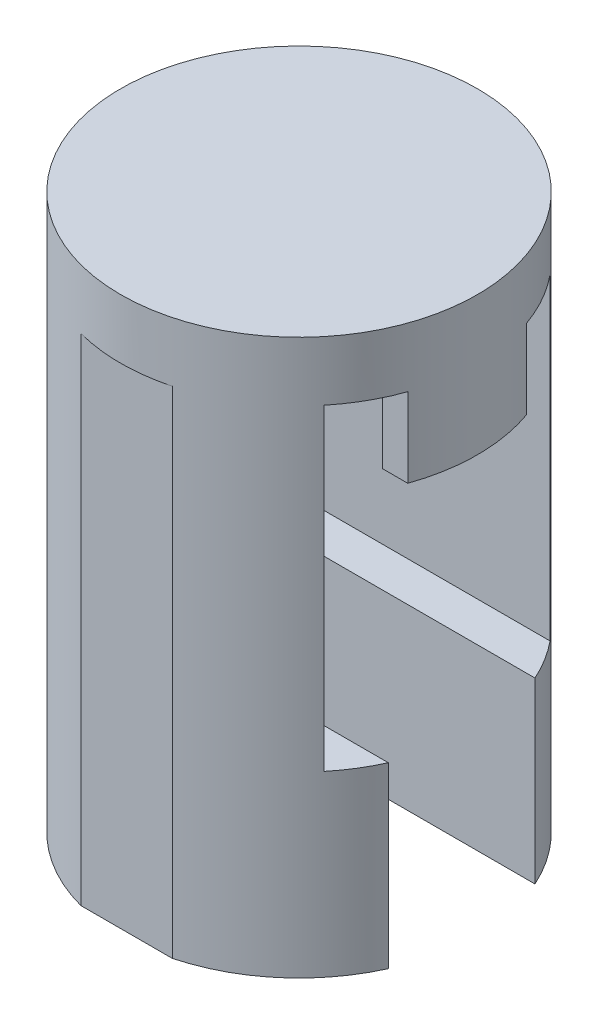
ISO-10303-21;
HEADER;
FILE_DESCRIPTION(('STEP AP214'),'2;1');
FILE_NAME('part.step','',(''),(''),'','','');
FILE_SCHEMA(('AUTOMOTIVE_DESIGN { 1 0 10303 214 1 1 1 1 }'));
ENDSEC;
DATA;
#1=APPLICATION_CONTEXT('core data for automotive mechanical design processes');
#2=APPLICATION_PROTOCOL_DEFINITION('international standard','automotive_design',2000,#1);
#3=PRODUCT_CONTEXT('',#1,'mechanical');
#4=PRODUCT('Part','Part','',(#3));
#5=PRODUCT_RELATED_PRODUCT_CATEGORY('part','',(#4));
#6=PRODUCT_DEFINITION_FORMATION('','',#4);
#7=PRODUCT_DEFINITION_CONTEXT('part definition',#1,'design');
#8=PRODUCT_DEFINITION('design','',#6,#7);
#9=PRODUCT_DEFINITION_SHAPE('','',#8);
#10=(LENGTH_UNIT() NAMED_UNIT(*) SI_UNIT(.MILLI.,.METRE.));
#11=(NAMED_UNIT(*) PLANE_ANGLE_UNIT() SI_UNIT($,.RADIAN.));
#12=(NAMED_UNIT(*) SI_UNIT($,.STERADIAN.) SOLID_ANGLE_UNIT());
#13=UNCERTAINTY_MEASURE_WITH_UNIT(LENGTH_MEASURE(1.E-05),#10,'distance_accuracy_value','');
#14=(GEOMETRIC_REPRESENTATION_CONTEXT(3) GLOBAL_UNCERTAINTY_ASSIGNED_CONTEXT((#13)) GLOBAL_UNIT_ASSIGNED_CONTEXT((#10,
#11,#12)) REPRESENTATION_CONTEXT('',''));
#15=CARTESIAN_POINT('',(0.,0.,0.));
#16=DIRECTION('',(0.,0.,1.));
#17=DIRECTION('',(1.,0.,0.));
#18=AXIS2_PLACEMENT_3D('',#15,#16,#17);
#19=CARTESIAN_POINT('',(0.,0.,0.));
#20=DIRECTION('',(0.,1.,0.));
#21=DIRECTION('',(0.,0.,1.));
#22=AXIS2_PLACEMENT_3D('',#19,#20,#21);
#23=PLANE('',#22);
#24=DIRECTION('',(-1.,0.,0.));
#25=VECTOR('',#24,1.);
#26=CARTESIAN_POINT('',(0.,0.,1.49999999999992));
#27=LINE('',#26,#25);
#28=CARTESIAN_POINT('',(-3.6,0.,1.49999999999999));
#29=VERTEX_POINT('',#28);
#30=CARTESIAN_POINT('',(-4.24264068711928,0.,1.5));
#31=VERTEX_POINT('',#30);
#32=EDGE_CURVE('E250',#29,#31,#27,.T.);
#33=ORIENTED_EDGE('',*,*,#32,.F.);
#34=CARTESIAN_POINT('',(0.,0.,0.));
#35=DIRECTION('',(0.,-1.,0.));
#36=DIRECTION('',(0.,0.,-1.));
#37=AXIS2_PLACEMENT_3D('',#34,#35,#36);
#38=CIRCLE('',#37,3.9);
#39=CARTESIAN_POINT('',(-3.6,0.,-1.50000000000001));
#40=VERTEX_POINT('',#39);
#41=EDGE_CURVE('E235',#29,#40,#38,.T.);
#42=ORIENTED_EDGE('',*,*,#41,.T.);
#43=DIRECTION('',(-1.,0.,0.));
#44=VECTOR('',#43,1.);
#45=CARTESIAN_POINT('',(0.,0.,-1.50000000000008));
#46=LINE('',#45,#44);
#47=CARTESIAN_POINT('',(-4.24264068711928,0.,-1.5));
#48=VERTEX_POINT('',#47);
#49=EDGE_CURVE('E240',#40,#48,#46,.T.);
#50=ORIENTED_EDGE('',*,*,#49,.T.);
#51=CARTESIAN_POINT('',(0.,0.,0.));
#52=DIRECTION('',(0.,1.,0.));
#53=DIRECTION('',(0.,0.,1.));
#54=AXIS2_PLACEMENT_3D('',#51,#52,#53);
#55=CIRCLE('',#54,4.5);
#56=CARTESIAN_POINT('',(-3.48245602987317,0.,-2.85));
#57=VERTEX_POINT('',#56);
#58=EDGE_CURVE('E316',#57,#48,#55,.T.);
#59=ORIENTED_EDGE('',*,*,#58,.F.);
#60=DIRECTION('',(-1.,0.,0.));
#61=VECTOR('',#60,1.);
#62=CARTESIAN_POINT('',(0.,0.,-2.85));
#63=LINE('',#62,#61);
#64=CARTESIAN_POINT('',(3.48245602987317,0.,-2.85));
#65=VERTEX_POINT('',#64);
#66=EDGE_CURVE('E287',#65,#57,#63,.T.);
#67=ORIENTED_EDGE('',*,*,#66,.F.);
#68=CARTESIAN_POINT('',(4.24264068711928,0.,-1.5));
#69=VERTEX_POINT('',#68);
#70=EDGE_CURVE('E317',#69,#65,#55,.T.);
#71=ORIENTED_EDGE('',*,*,#70,.F.);
#72=DIRECTION('',(1.,0.,0.));
#73=VECTOR('',#72,1.);
#74=CARTESIAN_POINT('',(0.,0.,-1.50000000000002));
#75=LINE('',#74,#73);
#76=CARTESIAN_POINT('',(3.6,0.,-1.50000000000001));
#77=VERTEX_POINT('',#76);
#78=EDGE_CURVE('E275',#77,#69,#75,.T.);
#79=ORIENTED_EDGE('',*,*,#78,.F.);
#80=CARTESIAN_POINT('',(0.,0.,0.));
#81=DIRECTION('',(0.,-1.,0.));
#82=DIRECTION('',(0.,0.,-1.));
#83=AXIS2_PLACEMENT_3D('',#80,#81,#82);
#84=CIRCLE('',#83,3.9);
#85=CARTESIAN_POINT('',(3.6,0.,1.49999999999999));
#86=VERTEX_POINT('',#85);
#87=EDGE_CURVE('E260',#77,#86,#84,.T.);
#88=ORIENTED_EDGE('',*,*,#87,.T.);
#89=DIRECTION('',(1.,0.,0.));
#90=VECTOR('',#89,1.);
#91=CARTESIAN_POINT('',(0.,0.,1.49999999999998));
#92=LINE('',#91,#90);
#93=CARTESIAN_POINT('',(4.24264068711929,0.,1.5));
#94=VERTEX_POINT('',#93);
#95=EDGE_CURVE('E265',#86,#94,#92,.T.);
#96=ORIENTED_EDGE('',*,*,#95,.T.);
#97=CARTESIAN_POINT('',(3.48245602987317,0.,2.85));
#98=VERTEX_POINT('',#97);
#99=EDGE_CURVE('E44',#98,#94,#55,.T.);
#100=ORIENTED_EDGE('',*,*,#99,.F.);
#101=DIRECTION('',(1.,0.,0.));
#102=VECTOR('',#101,1.);
#103=CARTESIAN_POINT('',(0.,0.,2.85));
#104=LINE('',#103,#102);
#105=CARTESIAN_POINT('',(-3.48245602987317,0.,2.85));
#106=VERTEX_POINT('',#105);
#107=EDGE_CURVE('E302',#106,#98,#104,.T.);
#108=ORIENTED_EDGE('',*,*,#107,.F.);
#109=EDGE_CURVE('E315',#31,#106,#55,.T.);
#110=ORIENTED_EDGE('',*,*,#109,.F.);
#111=EDGE_LOOP('',(#33,#42,#50,#59,#67,#71,#79,#88,#96,#100,#108,#110));
#112=FACE_BOUND('',#111,.T.);
#113=ADVANCED_FACE('F35',(#112),#23,.F.);
#114=DIRECTION('',(1.,0.,0.));
#115=VECTOR('',#114,1.);
#116=CARTESIAN_POINT('',(0.,0.,-4.35));
#117=LINE('',#116,#115);
#118=CARTESIAN_POINT('',(-1.15217186218029,0.,-4.35));
#119=VERTEX_POINT('',#118);
#120=CARTESIAN_POINT('',(1.15217186218029,0.,-4.35));
#121=VERTEX_POINT('',#120);
#122=EDGE_CURVE('E285',#119,#121,#117,.T.);
#123=ORIENTED_EDGE('',*,*,#122,.F.);
#124=EDGE_CURVE('E319',#121,#119,#55,.T.);
#125=ORIENTED_EDGE('',*,*,#124,.F.);
#126=EDGE_LOOP('',(#123,#125));
#127=FACE_BOUND('',#126,.T.);
#128=ADVANCED_FACE('F357',(#127),#23,.F.);
#129=CARTESIAN_POINT('',(0.,1.5,0.));
#130=DIRECTION('',(0.,-1.,0.));
#131=DIRECTION('',(0.,0.,-1.));
#132=AXIS2_PLACEMENT_3D('',#129,#130,#131);
#133=CYLINDRICAL_SURFACE('',#132,4.5);
#134=CARTESIAN_POINT('',(0.,1.5,0.));
#135=DIRECTION('',(0.,1.,0.));
#136=DIRECTION('',(0.,0.,1.));
#137=AXIS2_PLACEMENT_3D('',#134,#135,#136);
#138=CIRCLE('',#137,4.5);
#139=CARTESIAN_POINT('',(0.,1.5,4.5));
#140=VERTEX_POINT('',#139);
#141=EDGE_CURVE('E11',#140,#140,#138,.T.);
#142=ORIENTED_EDGE('',*,*,#141,.F.);
#143=EDGE_LOOP('',(#142));
#144=FACE_BOUND('',#143,.T.);
#145=CARTESIAN_POINT('',(-1.15217186218029,0.,4.35));
#146=VERTEX_POINT('',#145);
#147=CARTESIAN_POINT('',(1.15217186218029,0.,4.35));
#148=VERTEX_POINT('',#147);
#149=EDGE_CURVE('E39',#146,#148,#55,.T.);
#150=ORIENTED_EDGE('',*,*,#149,.T.);
#151=DIRECTION('',(0.,1.,0.));
#152=VECTOR('',#151,1.);
#153=CARTESIAN_POINT('',(1.15217186218029,-2.,4.35));
#154=LINE('',#153,#152);
#155=CARTESIAN_POINT('',(1.15217186218029,-12.5,4.35));
#156=VERTEX_POINT('',#155);
#157=EDGE_CURVE('E181',#156,#148,#154,.T.);
#158=ORIENTED_EDGE('',*,*,#157,.F.);
#159=CARTESIAN_POINT('',(0.,-12.5,0.));
#160=DIRECTION('',(0.,-1.,0.));
#161=DIRECTION('',(0.,0.,-1.));
#162=AXIS2_PLACEMENT_3D('',#159,#160,#161);
#163=CIRCLE('',#162,4.5);
#164=CARTESIAN_POINT('',(4.10213359119373,-12.5,1.85));
#165=VERTEX_POINT('',#164);
#166=EDGE_CURVE('E173',#165,#156,#163,.T.);
#167=ORIENTED_EDGE('',*,*,#166,.F.);
#168=DIRECTION('',(0.,1.,0.));
#169=VECTOR('',#168,1.);
#170=CARTESIAN_POINT('',(4.10213359119373,-12.5,1.85));
#171=LINE('',#170,#169);
#172=CARTESIAN_POINT('',(4.10213359119373,-8.,1.85));
#173=VERTEX_POINT('',#172);
#174=EDGE_CURVE('E178',#165,#173,#171,.T.);
#175=ORIENTED_EDGE('',*,*,#174,.T.);
#176=CARTESIAN_POINT('',(0.,-8.,0.));
#177=DIRECTION('',(0.,-1.,0.));
#178=DIRECTION('',(0.,0.,-1.));
#179=AXIS2_PLACEMENT_3D('',#176,#177,#178);
#180=CIRCLE('',#179,4.5);
#181=CARTESIAN_POINT('',(3.48245602987317,-8.,2.85));
#182=VERTEX_POINT('',#181);
#183=EDGE_CURVE('E348',#173,#182,#180,.T.);
#184=ORIENTED_EDGE('',*,*,#183,.T.);
#185=DIRECTION('',(0.,1.,0.));
#186=VECTOR('',#185,1.);
#187=CARTESIAN_POINT('',(3.48245602987317,-2.,2.85));
#188=LINE('',#187,#186);
#189=EDGE_CURVE('E306',#182,#98,#188,.T.);
#190=ORIENTED_EDGE('',*,*,#189,.T.);
#191=ORIENTED_EDGE('',*,*,#99,.T.);
#192=DIRECTION('',(0.,1.,0.));
#193=VECTOR('',#192,1.);
#194=CARTESIAN_POINT('',(4.24264068711929,-2.,1.5));
#195=LINE('',#194,#193);
#196=CARTESIAN_POINT('',(4.24264068711929,-2.,1.5));
#197=VERTEX_POINT('',#196);
#198=EDGE_CURVE('E280',#197,#94,#195,.T.);
#199=ORIENTED_EDGE('',*,*,#198,.F.);
#200=CARTESIAN_POINT('',(0.,-2.,0.));
#201=DIRECTION('',(0.,-1.,0.));
#202=DIRECTION('',(0.,0.,-1.));
#203=AXIS2_PLACEMENT_3D('',#200,#201,#202);
#204=CIRCLE('',#203,4.5);
#205=CARTESIAN_POINT('',(4.24264068711928,-2.,-1.5));
#206=VERTEX_POINT('',#205);
#207=EDGE_CURVE('E267',#206,#197,#204,.T.);
#208=ORIENTED_EDGE('',*,*,#207,.F.);
#209=DIRECTION('',(0.,1.,0.));
#210=VECTOR('',#209,1.);
#211=CARTESIAN_POINT('',(4.24264068711928,-2.,-1.5));
#212=LINE('',#211,#210);
#213=EDGE_CURVE('E58',#206,#69,#212,.T.);
#214=ORIENTED_EDGE('',*,*,#213,.T.);
#215=ORIENTED_EDGE('',*,*,#70,.T.);
#216=DIRECTION('',(0.,1.,0.));
#217=VECTOR('',#216,1.);
#218=CARTESIAN_POINT('',(3.48245602987317,-2.,-2.85));
#219=LINE('',#218,#217);
#220=CARTESIAN_POINT('',(3.48245602987317,-8.,-2.85));
#221=VERTEX_POINT('',#220);
#222=EDGE_CURVE('E292',#221,#65,#219,.T.);
#223=ORIENTED_EDGE('',*,*,#222,.F.);
#224=CARTESIAN_POINT('',(0.,-8.,0.));
#225=DIRECTION('',(0.,-1.,0.));
#226=DIRECTION('',(0.,0.,-1.));
#227=AXIS2_PLACEMENT_3D('',#224,#225,#226);
#228=CIRCLE('',#227,4.5);
#229=CARTESIAN_POINT('',(4.10213359119373,-8.,-1.85));
#230=VERTEX_POINT('',#229);
#231=EDGE_CURVE('E200',#221,#230,#228,.T.);
#232=ORIENTED_EDGE('',*,*,#231,.T.);
#233=DIRECTION('',(0.,1.,0.));
#234=VECTOR('',#233,1.);
#235=CARTESIAN_POINT('',(4.10213359119373,-12.5,-1.85));
#236=LINE('',#235,#234);
#237=CARTESIAN_POINT('',(4.10213359119373,-12.5,-1.85));
#238=VERTEX_POINT('',#237);
#239=EDGE_CURVE('E226',#238,#230,#236,.T.);
#240=ORIENTED_EDGE('',*,*,#239,.F.);
#241=CARTESIAN_POINT('',(0.,-12.5,0.));
#242=DIRECTION('',(0.,-1.,0.));
#243=DIRECTION('',(0.,0.,-1.));
#244=AXIS2_PLACEMENT_3D('',#241,#242,#243);
#245=CIRCLE('',#244,4.5);
#246=CARTESIAN_POINT('',(1.15217186218029,-12.5,-4.35));
#247=VERTEX_POINT('',#246);
#248=EDGE_CURVE('E208',#247,#238,#245,.T.);
#249=ORIENTED_EDGE('',*,*,#248,.F.);
#250=DIRECTION('',(0.,1.,0.));
#251=VECTOR('',#250,1.);
#252=CARTESIAN_POINT('',(1.15217186218029,-2.,-4.35));
#253=LINE('',#252,#251);
#254=EDGE_CURVE('E295',#247,#121,#253,.T.);
#255=ORIENTED_EDGE('',*,*,#254,.T.);
#256=ORIENTED_EDGE('',*,*,#124,.T.);
#257=DIRECTION('',(0.,1.,0.));
#258=VECTOR('',#257,1.);
#259=CARTESIAN_POINT('',(-1.15217186218029,-2.,-4.35));
#260=LINE('',#259,#258);
#261=CARTESIAN_POINT('',(-1.15217186218029,-12.5,-4.35));
#262=VERTEX_POINT('',#261);
#263=EDGE_CURVE('E298',#262,#119,#260,.T.);
#264=ORIENTED_EDGE('',*,*,#263,.F.);
#265=CARTESIAN_POINT('',(0.,-12.5,0.));
#266=DIRECTION('',(0.,-1.,0.));
#267=DIRECTION('',(0.,0.,-1.));
#268=AXIS2_PLACEMENT_3D('',#265,#266,#267);
#269=CIRCLE('',#268,4.5);
#270=CARTESIAN_POINT('',(-4.10213359119373,-12.5,-1.85));
#271=VERTEX_POINT('',#270);
#272=EDGE_CURVE('E214',#271,#262,#269,.T.);
#273=ORIENTED_EDGE('',*,*,#272,.F.);
#274=DIRECTION('',(0.,1.,0.));
#275=VECTOR('',#274,1.);
#276=CARTESIAN_POINT('',(-4.10213359119373,-12.5,-1.85));
#277=LINE('',#276,#275);
#278=CARTESIAN_POINT('',(-4.10213359119373,-8.,-1.85));
#279=VERTEX_POINT('',#278);
#280=EDGE_CURVE('E219',#271,#279,#277,.T.);
#281=ORIENTED_EDGE('',*,*,#280,.T.);
#282=CARTESIAN_POINT('',(0.,-8.,0.));
#283=DIRECTION('',(0.,-1.,0.));
#284=DIRECTION('',(0.,0.,-1.));
#285=AXIS2_PLACEMENT_3D('',#282,#283,#284);
#286=CIRCLE('',#285,4.5);
#287=CARTESIAN_POINT('',(-3.48245602987317,-8.,-2.85));
#288=VERTEX_POINT('',#287);
#289=EDGE_CURVE('E212',#279,#288,#286,.T.);
#290=ORIENTED_EDGE('',*,*,#289,.T.);
#291=DIRECTION('',(0.,1.,0.));
#292=VECTOR('',#291,1.);
#293=CARTESIAN_POINT('',(-3.48245602987317,-2.,-2.85));
#294=LINE('',#293,#292);
#295=EDGE_CURVE('E290',#288,#57,#294,.T.);
#296=ORIENTED_EDGE('',*,*,#295,.T.);
#297=ORIENTED_EDGE('',*,*,#58,.T.);
#298=DIRECTION('',(0.,1.,0.));
#299=VECTOR('',#298,1.);
#300=CARTESIAN_POINT('',(-4.24264068711928,-2.,-1.5));
#301=LINE('',#300,#299);
#302=CARTESIAN_POINT('',(-4.24264068711928,-2.,-1.5));
#303=VERTEX_POINT('',#302);
#304=EDGE_CURVE('E255',#303,#48,#301,.T.);
#305=ORIENTED_EDGE('',*,*,#304,.F.);
#306=CARTESIAN_POINT('',(0.,-2.,0.));
#307=DIRECTION('',(0.,-1.,0.));
#308=DIRECTION('',(0.,0.,-1.));
#309=AXIS2_PLACEMENT_3D('',#306,#307,#308);
#310=CIRCLE('',#309,4.5);
#311=CARTESIAN_POINT('',(-4.24264068711928,-2.,1.5));
#312=VERTEX_POINT('',#311);
#313=EDGE_CURVE('E242',#312,#303,#310,.T.);
#314=ORIENTED_EDGE('',*,*,#313,.F.);
#315=DIRECTION('',(0.,1.,0.));
#316=VECTOR('',#315,1.);
#317=CARTESIAN_POINT('',(-4.24264068711928,-2.,1.5));
#318=LINE('',#317,#316);
#319=EDGE_CURVE('E51',#312,#31,#318,.T.);
#320=ORIENTED_EDGE('',*,*,#319,.T.);
#321=ORIENTED_EDGE('',*,*,#109,.T.);
#322=DIRECTION('',(0.,1.,0.));
#323=VECTOR('',#322,1.);
#324=CARTESIAN_POINT('',(-3.48245602987317,-2.,2.85));
#325=LINE('',#324,#323);
#326=CARTESIAN_POINT('',(-3.48245602987317,-8.,2.85));
#327=VERTEX_POINT('',#326);
#328=EDGE_CURVE('E309',#327,#106,#325,.T.);
#329=ORIENTED_EDGE('',*,*,#328,.F.);
#330=CARTESIAN_POINT('',(-4.10213359119373,-8.,1.85));
#331=VERTEX_POINT('',#330);
#332=EDGE_CURVE('E195',#327,#331,#180,.T.);
#333=ORIENTED_EDGE('',*,*,#332,.T.);
#334=DIRECTION('',(0.,1.,0.));
#335=VECTOR('',#334,1.);
#336=CARTESIAN_POINT('',(-4.10213359119373,-12.5,1.85));
#337=LINE('',#336,#335);
#338=CARTESIAN_POINT('',(-4.10213359119373,-12.5,1.85));
#339=VERTEX_POINT('',#338);
#340=EDGE_CURVE('E201',#339,#331,#337,.T.);
#341=ORIENTED_EDGE('',*,*,#340,.F.);
#342=CARTESIAN_POINT('',(-1.15217186218029,-12.5,4.35));
#343=VERTEX_POINT('',#342);
#344=EDGE_CURVE('E188',#343,#339,#163,.T.);
#345=ORIENTED_EDGE('',*,*,#344,.F.);
#346=DIRECTION('',(0.,1.,0.));
#347=VECTOR('',#346,1.);
#348=CARTESIAN_POINT('',(-1.15217186218029,-2.,4.35));
#349=LINE('',#348,#347);
#350=EDGE_CURVE('E312',#343,#146,#349,.T.);
#351=ORIENTED_EDGE('',*,*,#350,.T.);
#352=EDGE_LOOP('',(#150,#158,#167,#175,#184,#190,#191,#199,#208,#214,#215,#223,#232,#240,#249,
#255,#256,#264,#273,#281,#290,#296,#297,#305,#314,#320,#321,#329,#333,#341,#345,#351));
#353=FACE_BOUND('',#352,.T.);
#354=ADVANCED_FACE('F37',(#144,#353),#133,.T.);
#355=CARTESIAN_POINT('',(0.,1.5,0.));
#356=DIRECTION('',(0.,1.,0.));
#357=DIRECTION('',(0.,0.,1.));
#358=AXIS2_PLACEMENT_3D('',#355,#356,#357);
#359=PLANE('',#358);
#360=ORIENTED_EDGE('',*,*,#141,.T.);
#361=EDGE_LOOP('',(#360));
#362=FACE_BOUND('',#361,.T.);
#363=ADVANCED_FACE('F356',(#362),#359,.T.);
#364=ORIENTED_EDGE('',*,*,#149,.F.);
#365=DIRECTION('',(1.,0.,0.));
#366=VECTOR('',#365,1.);
#367=CARTESIAN_POINT('',(0.,0.,4.35));
#368=LINE('',#367,#366);
#369=EDGE_CURVE('E300',#146,#148,#368,.T.);
#370=ORIENTED_EDGE('',*,*,#369,.T.);
#371=EDGE_LOOP('',(#364,#370));
#372=FACE_BOUND('',#371,.T.);
#373=ADVANCED_FACE('F354',(#372),#23,.F.);
#374=CARTESIAN_POINT('',(0.,-2.,4.35));
#375=DIRECTION('',(0.,0.,1.));
#376=DIRECTION('',(1.,0.,0.));
#377=AXIS2_PLACEMENT_3D('',#374,#375,#376);
#378=PLANE('',#377);
#379=ORIENTED_EDGE('',*,*,#369,.F.);
#380=ORIENTED_EDGE('',*,*,#350,.F.);
#381=DIRECTION('',(-1.,0.,0.));
#382=VECTOR('',#381,1.);
#383=CARTESIAN_POINT('',(0.,-12.5,4.35));
#384=LINE('',#383,#382);
#385=EDGE_CURVE('E185',#156,#343,#384,.T.);
#386=ORIENTED_EDGE('',*,*,#385,.F.);
#387=ORIENTED_EDGE('',*,*,#157,.T.);
#388=EDGE_LOOP('',(#379,#380,#386,#387));
#389=FACE_BOUND('',#388,.T.);
#390=ADVANCED_FACE('F352',(#389),#378,.T.);
#391=CARTESIAN_POINT('',(0.,-2.,2.85));
#392=DIRECTION('',(0.,0.,1.));
#393=DIRECTION('',(1.,0.,0.));
#394=AXIS2_PLACEMENT_3D('',#391,#392,#393);
#395=PLANE('',#394);
#396=ORIENTED_EDGE('',*,*,#107,.T.);
#397=ORIENTED_EDGE('',*,*,#189,.F.);
#398=DIRECTION('',(1.,0.,0.));
#399=VECTOR('',#398,1.);
#400=CARTESIAN_POINT('',(0.,-8.,2.85));
#401=LINE('',#400,#399);
#402=EDGE_CURVE('E232',#327,#182,#401,.T.);
#403=ORIENTED_EDGE('',*,*,#402,.F.);
#404=ORIENTED_EDGE('',*,*,#328,.T.);
#405=EDGE_LOOP('',(#396,#397,#403,#404));
#406=FACE_BOUND('',#405,.T.);
#407=ADVANCED_FACE('F362',(#406),#395,.F.);
#408=CARTESIAN_POINT('',(0.,-2.,-4.35));
#409=DIRECTION('',(0.,0.,1.));
#410=DIRECTION('',(1.,0.,0.));
#411=AXIS2_PLACEMENT_3D('',#408,#409,#410);
#412=PLANE('',#411);
#413=ORIENTED_EDGE('',*,*,#122,.T.);
#414=ORIENTED_EDGE('',*,*,#254,.F.);
#415=DIRECTION('',(1.,0.,0.));
#416=VECTOR('',#415,1.);
#417=CARTESIAN_POINT('',(0.,-12.5,-4.35));
#418=LINE('',#417,#416);
#419=EDGE_CURVE('E217',#262,#247,#418,.T.);
#420=ORIENTED_EDGE('',*,*,#419,.F.);
#421=ORIENTED_EDGE('',*,*,#263,.T.);
#422=EDGE_LOOP('',(#413,#414,#420,#421));
#423=FACE_BOUND('',#422,.T.);
#424=ADVANCED_FACE('F375',(#423),#412,.F.);
#425=CARTESIAN_POINT('',(0.,-2.,-2.85));
#426=DIRECTION('',(0.,0.,-1.));
#427=DIRECTION('',(-1.,0.,0.));
#428=AXIS2_PLACEMENT_3D('',#425,#426,#427);
#429=PLANE('',#428);
#430=ORIENTED_EDGE('',*,*,#66,.T.);
#431=ORIENTED_EDGE('',*,*,#295,.F.);
#432=DIRECTION('',(-1.,0.,0.));
#433=VECTOR('',#432,1.);
#434=CARTESIAN_POINT('',(0.,-8.,-2.85));
#435=LINE('',#434,#433);
#436=EDGE_CURVE('E229',#221,#288,#435,.T.);
#437=ORIENTED_EDGE('',*,*,#436,.F.);
#438=ORIENTED_EDGE('',*,*,#222,.T.);
#439=EDGE_LOOP('',(#430,#431,#437,#438));
#440=FACE_BOUND('',#439,.T.);
#441=ADVANCED_FACE('F391',(#440),#429,.F.);
#442=CARTESIAN_POINT('',(0.,-2.,0.));
#443=DIRECTION('',(0.,1.,0.));
#444=DIRECTION('',(0.,0.,1.));
#445=AXIS2_PLACEMENT_3D('',#442,#443,#444);
#446=CYLINDRICAL_SURFACE('',#445,3.9);
#447=ORIENTED_EDGE('',*,*,#87,.F.);
#448=DIRECTION('',(0.,1.,0.));
#449=VECTOR('',#448,1.);
#450=CARTESIAN_POINT('',(3.6,-2.,-1.50000000000001));
#451=LINE('',#450,#449);
#452=CARTESIAN_POINT('',(3.6,-2.,-1.50000000000001));
#453=VERTEX_POINT('',#452);
#454=EDGE_CURVE('E283',#453,#77,#451,.T.);
#455=ORIENTED_EDGE('',*,*,#454,.F.);
#456=CARTESIAN_POINT('',(0.,-2.,0.));
#457=DIRECTION('',(0.,-1.,0.));
#458=DIRECTION('',(0.,0.,-1.));
#459=AXIS2_PLACEMENT_3D('',#456,#457,#458);
#460=CIRCLE('',#459,3.9);
#461=CARTESIAN_POINT('',(3.6,-2.,1.49999999999999));
#462=VERTEX_POINT('',#461);
#463=EDGE_CURVE('E261',#453,#462,#460,.T.);
#464=ORIENTED_EDGE('',*,*,#463,.T.);
#465=DIRECTION('',(0.,1.,0.));
#466=VECTOR('',#465,1.);
#467=CARTESIAN_POINT('',(3.6,-2.,1.49999999999999));
#468=LINE('',#467,#466);
#469=EDGE_CURVE('E272',#462,#86,#468,.T.);
#470=ORIENTED_EDGE('',*,*,#469,.T.);
#471=EDGE_LOOP('',(#447,#455,#464,#470));
#472=FACE_BOUND('',#471,.T.);
#473=ADVANCED_FACE('F399',(#472),#446,.F.);
#474=CARTESIAN_POINT('',(0.,-2.,-1.50000000000002));
#475=DIRECTION('',(0.,0.,1.));
#476=DIRECTION('',(1.,0.,0.));
#477=AXIS2_PLACEMENT_3D('',#474,#475,#476);
#478=PLANE('',#477);
#479=ORIENTED_EDGE('',*,*,#78,.T.);
#480=ORIENTED_EDGE('',*,*,#213,.F.);
#481=DIRECTION('',(1.,0.,0.));
#482=VECTOR('',#481,1.);
#483=CARTESIAN_POINT('',(0.,-2.,-1.50000000000002));
#484=LINE('',#483,#482);
#485=EDGE_CURVE('E264',#453,#206,#484,.T.);
#486=ORIENTED_EDGE('',*,*,#485,.F.);
#487=ORIENTED_EDGE('',*,*,#454,.T.);
#488=EDGE_LOOP('',(#479,#480,#486,#487));
#489=FACE_BOUND('',#488,.T.);
#490=ADVANCED_FACE('F395',(#489),#478,.F.);
#491=CARTESIAN_POINT('',(0.,-2.,1.49999999999998));
#492=DIRECTION('',(0.,0.,1.));
#493=DIRECTION('',(1.,0.,0.));
#494=AXIS2_PLACEMENT_3D('',#491,#492,#493);
#495=PLANE('',#494);
#496=ORIENTED_EDGE('',*,*,#95,.F.);
#497=ORIENTED_EDGE('',*,*,#469,.F.);
#498=DIRECTION('',(1.,0.,0.));
#499=VECTOR('',#498,1.);
#500=CARTESIAN_POINT('',(0.,-2.,1.49999999999998));
#501=LINE('',#500,#499);
#502=EDGE_CURVE('E269',#462,#197,#501,.T.);
#503=ORIENTED_EDGE('',*,*,#502,.T.);
#504=ORIENTED_EDGE('',*,*,#198,.T.);
#505=EDGE_LOOP('',(#496,#497,#503,#504));
#506=FACE_BOUND('',#505,.T.);
#507=ADVANCED_FACE('F403',(#506),#495,.T.);
#508=CARTESIAN_POINT('',(0.,-2.,0.));
#509=DIRECTION('',(0.,-1.,0.));
#510=DIRECTION('',(0.,0.,-1.));
#511=AXIS2_PLACEMENT_3D('',#508,#509,#510);
#512=PLANE('',#511);
#513=ORIENTED_EDGE('',*,*,#463,.F.);
#514=ORIENTED_EDGE('',*,*,#485,.T.);
#515=ORIENTED_EDGE('',*,*,#207,.T.);
#516=ORIENTED_EDGE('',*,*,#502,.F.);
#517=EDGE_LOOP('',(#513,#514,#515,#516));
#518=FACE_BOUND('',#517,.T.);
#519=ADVANCED_FACE('F419',(#518),#512,.T.);
#520=CARTESIAN_POINT('',(0.,-2.,0.));
#521=DIRECTION('',(0.,1.,0.));
#522=DIRECTION('',(0.,0.,1.));
#523=AXIS2_PLACEMENT_3D('',#520,#521,#522);
#524=CYLINDRICAL_SURFACE('',#523,3.9);
#525=ORIENTED_EDGE('',*,*,#41,.F.);
#526=DIRECTION('',(0.,1.,0.));
#527=VECTOR('',#526,1.);
#528=CARTESIAN_POINT('',(-3.6,-2.,1.49999999999999));
#529=LINE('',#528,#527);
#530=CARTESIAN_POINT('',(-3.6,-2.,1.49999999999999));
#531=VERTEX_POINT('',#530);
#532=EDGE_CURVE('E258',#531,#29,#529,.T.);
#533=ORIENTED_EDGE('',*,*,#532,.F.);
#534=CARTESIAN_POINT('',(0.,-2.,0.));
#535=DIRECTION('',(0.,-1.,0.));
#536=DIRECTION('',(0.,0.,-1.));
#537=AXIS2_PLACEMENT_3D('',#534,#535,#536);
#538=CIRCLE('',#537,3.9);
#539=CARTESIAN_POINT('',(-3.6,-2.,-1.50000000000001));
#540=VERTEX_POINT('',#539);
#541=EDGE_CURVE('E236',#531,#540,#538,.T.);
#542=ORIENTED_EDGE('',*,*,#541,.T.);
#543=DIRECTION('',(0.,1.,0.));
#544=VECTOR('',#543,1.);
#545=CARTESIAN_POINT('',(-3.6,-2.,-1.50000000000001));
#546=LINE('',#545,#544);
#547=EDGE_CURVE('E247',#540,#40,#546,.T.);
#548=ORIENTED_EDGE('',*,*,#547,.T.);
#549=EDGE_LOOP('',(#525,#533,#542,#548));
#550=FACE_BOUND('',#549,.T.);
#551=ADVANCED_FACE('F422',(#550),#524,.F.);
#552=CARTESIAN_POINT('',(0.,-2.,1.49999999999992));
#553=DIRECTION('',(0.,0.,-1.));
#554=DIRECTION('',(-1.,0.,0.));
#555=AXIS2_PLACEMENT_3D('',#552,#553,#554);
#556=PLANE('',#555);
#557=ORIENTED_EDGE('',*,*,#32,.T.);
#558=ORIENTED_EDGE('',*,*,#319,.F.);
#559=DIRECTION('',(-1.,0.,0.));
#560=VECTOR('',#559,1.);
#561=CARTESIAN_POINT('',(0.,-2.,1.49999999999992));
#562=LINE('',#561,#560);
#563=EDGE_CURVE('E239',#531,#312,#562,.T.);
#564=ORIENTED_EDGE('',*,*,#563,.F.);
#565=ORIENTED_EDGE('',*,*,#532,.T.);
#566=EDGE_LOOP('',(#557,#558,#564,#565));
#567=FACE_BOUND('',#566,.T.);
#568=ADVANCED_FACE('F340',(#567),#556,.F.);
#569=CARTESIAN_POINT('',(0.,-2.,-1.50000000000008));
#570=DIRECTION('',(0.,0.,-1.));
#571=DIRECTION('',(-1.,0.,0.));
#572=AXIS2_PLACEMENT_3D('',#569,#570,#571);
#573=PLANE('',#572);
#574=ORIENTED_EDGE('',*,*,#49,.F.);
#575=ORIENTED_EDGE('',*,*,#547,.F.);
#576=DIRECTION('',(-1.,0.,0.));
#577=VECTOR('',#576,1.);
#578=CARTESIAN_POINT('',(0.,-2.,-1.50000000000008));
#579=LINE('',#578,#577);
#580=EDGE_CURVE('E244',#540,#303,#579,.T.);
#581=ORIENTED_EDGE('',*,*,#580,.T.);
#582=ORIENTED_EDGE('',*,*,#304,.T.);
#583=EDGE_LOOP('',(#574,#575,#581,#582));
#584=FACE_BOUND('',#583,.T.);
#585=ADVANCED_FACE('F333',(#584),#573,.T.);
#586=CARTESIAN_POINT('',(0.,-2.,0.));
#587=DIRECTION('',(0.,-1.,0.));
#588=DIRECTION('',(0.,0.,-1.));
#589=AXIS2_PLACEMENT_3D('',#586,#587,#588);
#590=PLANE('',#589);
#591=ORIENTED_EDGE('',*,*,#541,.F.);
#592=ORIENTED_EDGE('',*,*,#563,.T.);
#593=ORIENTED_EDGE('',*,*,#313,.T.);
#594=ORIENTED_EDGE('',*,*,#580,.F.);
#595=EDGE_LOOP('',(#591,#592,#593,#594));
#596=FACE_BOUND('',#595,.T.);
#597=ADVANCED_FACE('F337',(#596),#590,.T.);
#598=CARTESIAN_POINT('',(0.,-8.,0.));
#599=DIRECTION('',(0.,-1.,0.));
#600=DIRECTION('',(0.,0.,-1.));
#601=AXIS2_PLACEMENT_3D('',#598,#599,#600);
#602=PLANE('',#601);
#603=ORIENTED_EDGE('',*,*,#231,.F.);
#604=ORIENTED_EDGE('',*,*,#436,.T.);
#605=ORIENTED_EDGE('',*,*,#289,.F.);
#606=DIRECTION('',(-1.,0.,0.));
#607=VECTOR('',#606,1.);
#608=CARTESIAN_POINT('',(0.,-8.,-1.85));
#609=LINE('',#608,#607);
#610=EDGE_CURVE('E203',#230,#279,#609,.T.);
#611=ORIENTED_EDGE('',*,*,#610,.F.);
#612=EDGE_LOOP('',(#603,#604,#605,#611));
#613=FACE_BOUND('',#612,.T.);
#614=ADVANCED_FACE('F388',(#613),#602,.F.);
#615=CARTESIAN_POINT('',(0.,-12.5,-1.85));
#616=DIRECTION('',(0.,0.,-1.));
#617=DIRECTION('',(-1.,0.,0.));
#618=AXIS2_PLACEMENT_3D('',#615,#616,#617);
#619=PLANE('',#618);
#620=ORIENTED_EDGE('',*,*,#610,.T.);
#621=ORIENTED_EDGE('',*,*,#280,.F.);
#622=DIRECTION('',(-1.,0.,0.));
#623=VECTOR('',#622,1.);
#624=CARTESIAN_POINT('',(0.,-12.5,-1.85));
#625=LINE('',#624,#623);
#626=EDGE_CURVE('E211',#238,#271,#625,.T.);
#627=ORIENTED_EDGE('',*,*,#626,.F.);
#628=ORIENTED_EDGE('',*,*,#239,.T.);
#629=EDGE_LOOP('',(#620,#621,#627,#628));
#630=FACE_BOUND('',#629,.T.);
#631=ADVANCED_FACE('F433',(#630),#619,.F.);
#632=CARTESIAN_POINT('',(0.,-12.5,0.));
#633=DIRECTION('',(0.,-1.,0.));
#634=DIRECTION('',(0.,0.,-1.));
#635=AXIS2_PLACEMENT_3D('',#632,#633,#634);
#636=PLANE('',#635);
#637=ORIENTED_EDGE('',*,*,#248,.T.);
#638=ORIENTED_EDGE('',*,*,#626,.T.);
#639=ORIENTED_EDGE('',*,*,#272,.T.);
#640=ORIENTED_EDGE('',*,*,#419,.T.);
#641=EDGE_LOOP('',(#637,#638,#639,#640));
#642=FACE_BOUND('',#641,.T.);
#643=ADVANCED_FACE('F380',(#642),#636,.T.);
#644=CARTESIAN_POINT('',(0.,-8.,0.));
#645=DIRECTION('',(0.,-1.,0.));
#646=DIRECTION('',(0.,0.,-1.));
#647=AXIS2_PLACEMENT_3D('',#644,#645,#646);
#648=PLANE('',#647);
#649=ORIENTED_EDGE('',*,*,#332,.F.);
#650=ORIENTED_EDGE('',*,*,#402,.T.);
#651=ORIENTED_EDGE('',*,*,#183,.F.);
#652=DIRECTION('',(1.,0.,0.));
#653=VECTOR('',#652,1.);
#654=CARTESIAN_POINT('',(0.,-8.,1.85));
#655=LINE('',#654,#653);
#656=EDGE_CURVE('E199',#331,#173,#655,.T.);
#657=ORIENTED_EDGE('',*,*,#656,.F.);
#658=EDGE_LOOP('',(#649,#650,#651,#657));
#659=FACE_BOUND('',#658,.T.);
#660=ADVANCED_FACE('F347',(#659),#648,.F.);
#661=CARTESIAN_POINT('',(0.,-12.5,1.85));
#662=DIRECTION('',(0.,0.,1.));
#663=DIRECTION('',(1.,0.,0.));
#664=AXIS2_PLACEMENT_3D('',#661,#662,#663);
#665=PLANE('',#664);
#666=ORIENTED_EDGE('',*,*,#656,.T.);
#667=ORIENTED_EDGE('',*,*,#174,.F.);
#668=DIRECTION('',(1.,0.,0.));
#669=VECTOR('',#668,1.);
#670=CARTESIAN_POINT('',(0.,-12.5,1.85));
#671=LINE('',#670,#669);
#672=EDGE_CURVE('E186',#339,#165,#671,.T.);
#673=ORIENTED_EDGE('',*,*,#672,.F.);
#674=ORIENTED_EDGE('',*,*,#340,.T.);
#675=EDGE_LOOP('',(#666,#667,#673,#674));
#676=FACE_BOUND('',#675,.T.);
#677=ADVANCED_FACE('F197',(#676),#665,.F.);
#678=CARTESIAN_POINT('',(0.,-12.5,0.));
#679=DIRECTION('',(0.,-1.,0.));
#680=DIRECTION('',(0.,0.,-1.));
#681=AXIS2_PLACEMENT_3D('',#678,#679,#680);
#682=PLANE('',#681);
#683=ORIENTED_EDGE('',*,*,#672,.T.);
#684=ORIENTED_EDGE('',*,*,#166,.T.);
#685=ORIENTED_EDGE('',*,*,#385,.T.);
#686=ORIENTED_EDGE('',*,*,#344,.T.);
#687=EDGE_LOOP('',(#683,#684,#685,#686));
#688=FACE_BOUND('',#687,.T.);
#689=ADVANCED_FACE('F190',(#688),#682,.T.);
#690=CLOSED_SHELL('',(#113,#128,#354,#363,#373,#390,#407,#424,#441,#473,#490,#507,#519,#551,
#568,#585,#597,#614,#631,#643,#660,#677,#689));
#691=MANIFOLD_SOLID_BREP('B2',#690);
#692=ADVANCED_BREP_SHAPE_REPRESENTATION('',(#18,#691),#14);
#693=SHAPE_DEFINITION_REPRESENTATION(#9,#692);
ENDSEC;
END-ISO-10303-21;
